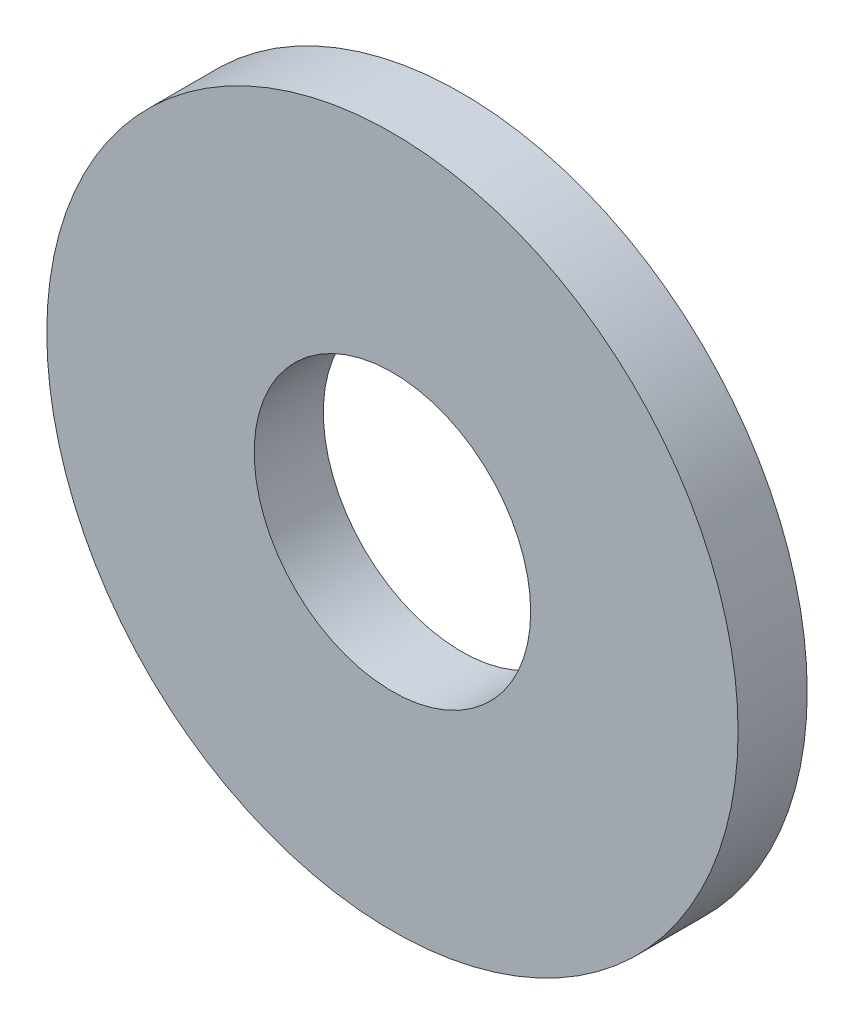
ISO-10303-21;
HEADER;
FILE_DESCRIPTION(('STEP AP214'),'2;1');
FILE_NAME('part.step','',(''),(''),'','','');
FILE_SCHEMA(('AUTOMOTIVE_DESIGN { 1 0 10303 214 1 1 1 1 }'));
ENDSEC;
DATA;
#1=APPLICATION_CONTEXT('core data for automotive mechanical design processes');
#2=APPLICATION_PROTOCOL_DEFINITION('international standard','automotive_design',2000,#1);
#3=PRODUCT_CONTEXT('',#1,'mechanical');
#4=PRODUCT('Part','Part','',(#3));
#5=PRODUCT_RELATED_PRODUCT_CATEGORY('part','',(#4));
#6=PRODUCT_DEFINITION_FORMATION('','',#4);
#7=PRODUCT_DEFINITION_CONTEXT('part definition',#1,'design');
#8=PRODUCT_DEFINITION('design','',#6,#7);
#9=PRODUCT_DEFINITION_SHAPE('','',#8);
#10=(LENGTH_UNIT() NAMED_UNIT(*) SI_UNIT(.MILLI.,.METRE.));
#11=(NAMED_UNIT(*) PLANE_ANGLE_UNIT() SI_UNIT($,.RADIAN.));
#12=(NAMED_UNIT(*) SI_UNIT($,.STERADIAN.) SOLID_ANGLE_UNIT());
#13=UNCERTAINTY_MEASURE_WITH_UNIT(LENGTH_MEASURE(1.E-05),#10,'distance_accuracy_value','');
#14=(GEOMETRIC_REPRESENTATION_CONTEXT(3) GLOBAL_UNCERTAINTY_ASSIGNED_CONTEXT((#13)) GLOBAL_UNIT_ASSIGNED_CONTEXT((#10,
#11,#12)) REPRESENTATION_CONTEXT('',''));
#15=CARTESIAN_POINT('',(0.,0.,0.));
#16=DIRECTION('',(0.,0.,1.));
#17=DIRECTION('',(1.,0.,0.));
#18=AXIS2_PLACEMENT_3D('',#15,#16,#17);
#19=CARTESIAN_POINT('',(0.,0.,0.4));
#20=DIRECTION('',(0.,0.,1.));
#21=DIRECTION('',(1.,0.,0.));
#22=AXIS2_PLACEMENT_3D('',#19,#20,#21);
#23=PLANE('',#22);
#24=CARTESIAN_POINT('',(0.,0.,0.4));
#25=DIRECTION('',(0.,0.,1.));
#26=DIRECTION('',(1.,0.,0.));
#27=AXIS2_PLACEMENT_3D('',#24,#25,#26);
#28=CIRCLE('',#27,4.);
#29=CARTESIAN_POINT('',(4.,0.,0.4));
#30=VERTEX_POINT('',#29);
#31=EDGE_CURVE('E10',#30,#30,#28,.T.);
#32=ORIENTED_EDGE('',*,*,#31,.T.);
#33=EDGE_LOOP('',(#32));
#34=FACE_BOUND('',#33,.T.);
#35=CARTESIAN_POINT('',(0.,0.,0.4));
#36=DIRECTION('',(0.,0.,1.));
#37=DIRECTION('',(1.,0.,0.));
#38=AXIS2_PLACEMENT_3D('',#35,#36,#37);
#39=CIRCLE('',#38,1.6);
#40=CARTESIAN_POINT('',(1.6,0.,0.4));
#41=VERTEX_POINT('',#40);
#42=EDGE_CURVE('E41',#41,#41,#39,.T.);
#43=ORIENTED_EDGE('',*,*,#42,.F.);
#44=EDGE_LOOP('',(#43));
#45=FACE_BOUND('',#44,.T.);
#46=ADVANCED_FACE('F30',(#34,#45),#23,.T.);
#47=CARTESIAN_POINT('',(0.,0.,-0.4));
#48=DIRECTION('',(0.,0.,1.));
#49=DIRECTION('',(1.,0.,0.));
#50=AXIS2_PLACEMENT_3D('',#47,#48,#49);
#51=PLANE('',#50);
#52=CARTESIAN_POINT('',(0.,0.,-0.4));
#53=DIRECTION('',(0.,0.,1.));
#54=DIRECTION('',(1.,0.,0.));
#55=AXIS2_PLACEMENT_3D('',#52,#53,#54);
#56=CIRCLE('',#55,4.);
#57=CARTESIAN_POINT('',(4.,0.,-0.4));
#58=VERTEX_POINT('',#57);
#59=EDGE_CURVE('E34',#58,#58,#56,.T.);
#60=ORIENTED_EDGE('',*,*,#59,.F.);
#61=EDGE_LOOP('',(#60));
#62=FACE_BOUND('',#61,.T.);
#63=CARTESIAN_POINT('',(0.,0.,-0.4));
#64=DIRECTION('',(0.,0.,1.));
#65=DIRECTION('',(1.,0.,0.));
#66=AXIS2_PLACEMENT_3D('',#63,#64,#65);
#67=CIRCLE('',#66,1.6);
#68=CARTESIAN_POINT('',(1.6,0.,-0.4));
#69=VERTEX_POINT('',#68);
#70=EDGE_CURVE('E43',#69,#69,#67,.T.);
#71=ORIENTED_EDGE('',*,*,#70,.T.);
#72=EDGE_LOOP('',(#71));
#73=FACE_BOUND('',#72,.T.);
#74=ADVANCED_FACE('F53',(#62,#73),#51,.F.);
#75=CARTESIAN_POINT('',(0.,0.,0.4));
#76=DIRECTION('',(0.,0.,-1.));
#77=DIRECTION('',(-1.,0.,0.));
#78=AXIS2_PLACEMENT_3D('',#75,#76,#77);
#79=CYLINDRICAL_SURFACE('',#78,4.);
#80=ORIENTED_EDGE('',*,*,#31,.F.);
#81=EDGE_LOOP('',(#80));
#82=FACE_BOUND('',#81,.T.);
#83=ORIENTED_EDGE('',*,*,#59,.T.);
#84=EDGE_LOOP('',(#83));
#85=FACE_BOUND('',#84,.T.);
#86=ADVANCED_FACE('F32',(#82,#85),#79,.T.);
#87=CARTESIAN_POINT('',(0.,0.,0.4));
#88=DIRECTION('',(0.,0.,-1.));
#89=DIRECTION('',(-1.,0.,0.));
#90=AXIS2_PLACEMENT_3D('',#87,#88,#89);
#91=CYLINDRICAL_SURFACE('',#90,1.6);
#92=ORIENTED_EDGE('',*,*,#42,.T.);
#93=EDGE_LOOP('',(#92));
#94=FACE_BOUND('',#93,.T.);
#95=ORIENTED_EDGE('',*,*,#70,.F.);
#96=EDGE_LOOP('',(#95));
#97=FACE_BOUND('',#96,.T.);
#98=ADVANCED_FACE('F49',(#94,#97),#91,.F.);
#99=CLOSED_SHELL('',(#46,#74,#86,#98));
#100=MANIFOLD_SOLID_BREP('B2',#99);
#101=ADVANCED_BREP_SHAPE_REPRESENTATION('',(#18,#100),#14);
#102=SHAPE_DEFINITION_REPRESENTATION(#9,#101);
ENDSEC;
END-ISO-10303-21;
